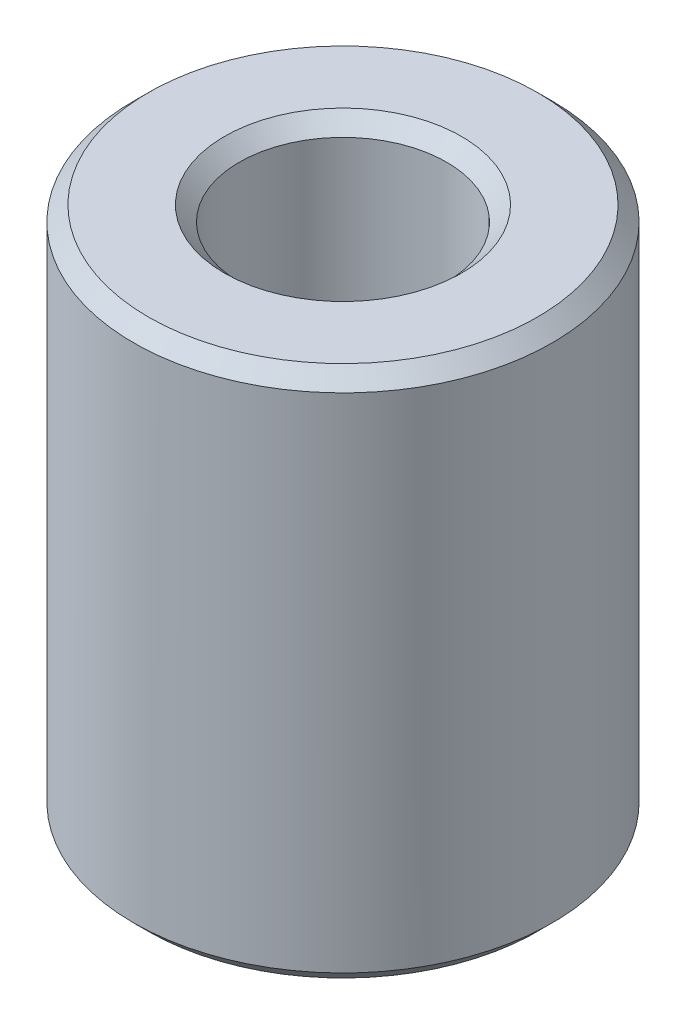
ISO-10303-21;
HEADER;
FILE_DESCRIPTION(('STEP AP214'),'2;1');
FILE_NAME('part.step','',(''),(''),'','','');
FILE_SCHEMA(('AUTOMOTIVE_DESIGN { 1 0 10303 214 1 1 1 1 }'));
ENDSEC;
DATA;
#1=APPLICATION_CONTEXT('core data for automotive mechanical design processes');
#2=APPLICATION_PROTOCOL_DEFINITION('international standard','automotive_design',2000,#1);
#3=PRODUCT_CONTEXT('',#1,'mechanical');
#4=PRODUCT('Part','Part','',(#3));
#5=PRODUCT_RELATED_PRODUCT_CATEGORY('part','',(#4));
#6=PRODUCT_DEFINITION_FORMATION('','',#4);
#7=PRODUCT_DEFINITION_CONTEXT('part definition',#1,'design');
#8=PRODUCT_DEFINITION('design','',#6,#7);
#9=PRODUCT_DEFINITION_SHAPE('','',#8);
#10=(LENGTH_UNIT() NAMED_UNIT(*) SI_UNIT(.MILLI.,.METRE.));
#11=(NAMED_UNIT(*) PLANE_ANGLE_UNIT() SI_UNIT($,.RADIAN.));
#12=(NAMED_UNIT(*) SI_UNIT($,.STERADIAN.) SOLID_ANGLE_UNIT());
#13=UNCERTAINTY_MEASURE_WITH_UNIT(LENGTH_MEASURE(1.E-05),#10,'distance_accuracy_value','');
#14=(GEOMETRIC_REPRESENTATION_CONTEXT(3) GLOBAL_UNCERTAINTY_ASSIGNED_CONTEXT((#13)) GLOBAL_UNIT_ASSIGNED_CONTEXT((#10,
#11,#12)) REPRESENTATION_CONTEXT('',''));
#15=CARTESIAN_POINT('',(0.,0.,0.));
#16=DIRECTION('',(0.,0.,1.));
#17=DIRECTION('',(1.,0.,0.));
#18=AXIS2_PLACEMENT_3D('',#15,#16,#17);
#19=CARTESIAN_POINT('',(0.,19.0598782989503,0.));
#20=DIRECTION('',(0.,-1.,0.));
#21=DIRECTION('',(0.,0.,-1.));
#22=AXIS2_PLACEMENT_3D('',#19,#20,#21);
#23=CYLINDRICAL_SURFACE('',#22,7.5);
#24=CARTESIAN_POINT('',(0.,0.532516830495152,0.));
#25=DIRECTION('',(0.,1.,0.));
#26=DIRECTION('',(0.,0.,1.));
#27=AXIS2_PLACEMENT_3D('',#24,#25,#26);
#28=CIRCLE('',#27,7.5);
#29=CARTESIAN_POINT('',(0.,0.532516830495152,7.5));
#30=VERTEX_POINT('',#29);
#31=EDGE_CURVE('E10',#30,#30,#28,.T.);
#32=ORIENTED_EDGE('',*,*,#31,.T.);
#33=EDGE_LOOP('',(#32));
#34=FACE_BOUND('',#33,.T.);
#35=CARTESIAN_POINT('',(0.,18.5273614684551,0.));
#36=DIRECTION('',(0.,1.,0.));
#37=DIRECTION('',(0.,0.,1.));
#38=AXIS2_PLACEMENT_3D('',#35,#36,#37);
#39=CIRCLE('',#38,7.5);
#40=CARTESIAN_POINT('',(0.,18.5273614684551,-7.5));
#41=VERTEX_POINT('',#40);
#42=EDGE_CURVE('E50',#41,#41,#39,.F.);
#43=ORIENTED_EDGE('',*,*,#42,.T.);
#44=EDGE_LOOP('',(#43));
#45=FACE_BOUND('',#44,.T.);
#46=ADVANCED_FACE('F39',(#34,#45),#23,.T.);
#47=CARTESIAN_POINT('',(0.,19.0598782989503,0.));
#48=DIRECTION('',(0.,1.,0.));
#49=DIRECTION('',(0.,0.,1.));
#50=AXIS2_PLACEMENT_3D('',#47,#48,#49);
#51=PLANE('',#50);
#52=CARTESIAN_POINT('',(0.,19.0598782989503,0.));
#53=DIRECTION('',(0.,1.,0.));
#54=DIRECTION('',(0.,0.,1.));
#55=AXIS2_PLACEMENT_3D('',#52,#53,#54);
#56=CIRCLE('',#55,4.24500124139866);
#57=CARTESIAN_POINT('',(0.,19.0598782989503,4.24500124139866));
#58=VERTEX_POINT('',#57);
#59=EDGE_CURVE('E58',#58,#58,#56,.F.);
#60=ORIENTED_EDGE('',*,*,#59,.T.);
#61=EDGE_LOOP('',(#60));
#62=FACE_BOUND('',#61,.T.);
#63=CARTESIAN_POINT('',(0.,19.0598782989503,0.));
#64=DIRECTION('',(0.,1.,0.));
#65=DIRECTION('',(0.,0.,1.));
#66=AXIS2_PLACEMENT_3D('',#63,#64,#65);
#67=CIRCLE('',#66,6.96748316950484);
#68=CARTESIAN_POINT('',(0.,19.0598782989503,-6.96748316950485));
#69=VERTEX_POINT('',#68);
#70=EDGE_CURVE('E61',#69,#69,#67,.T.);
#71=ORIENTED_EDGE('',*,*,#70,.T.);
#72=EDGE_LOOP('',(#71));
#73=FACE_BOUND('',#72,.T.);
#74=ADVANCED_FACE('F88',(#62,#73),#51,.T.);
#75=CARTESIAN_POINT('',(0.,0.,0.));
#76=DIRECTION('',(0.,1.,0.));
#77=DIRECTION('',(0.,0.,1.));
#78=AXIS2_PLACEMENT_3D('',#75,#76,#77);
#79=PLANE('',#78);
#80=CARTESIAN_POINT('',(0.,0.,0.));
#81=DIRECTION('',(0.,1.,0.));
#82=DIRECTION('',(0.,0.,1.));
#83=AXIS2_PLACEMENT_3D('',#80,#81,#82);
#84=CIRCLE('',#83,4.24500124139865);
#85=CARTESIAN_POINT('',(0.,0.,4.24500124139865));
#86=VERTEX_POINT('',#85);
#87=EDGE_CURVE('E51',#86,#86,#84,.T.);
#88=ORIENTED_EDGE('',*,*,#87,.T.);
#89=EDGE_LOOP('',(#88));
#90=FACE_BOUND('',#89,.T.);
#91=CARTESIAN_POINT('',(0.,0.,0.));
#92=DIRECTION('',(0.,1.,0.));
#93=DIRECTION('',(0.,0.,1.));
#94=AXIS2_PLACEMENT_3D('',#91,#92,#93);
#95=CIRCLE('',#94,6.96748316950484);
#96=CARTESIAN_POINT('',(0.,0.,6.96748316950484));
#97=VERTEX_POINT('',#96);
#98=EDGE_CURVE('E54',#97,#97,#95,.F.);
#99=ORIENTED_EDGE('',*,*,#98,.T.);
#100=EDGE_LOOP('',(#99));
#101=FACE_BOUND('',#100,.T.);
#102=ADVANCED_FACE('F83',(#90,#101),#79,.F.);
#103=CARTESIAN_POINT('',(0.,19.0598782989503,0.));
#104=DIRECTION('',(0.,-1.,0.));
#105=DIRECTION('',(0.,0.,-1.));
#106=AXIS2_PLACEMENT_3D('',#103,#104,#105);
#107=CYLINDRICAL_SURFACE('',#106,3.7124844109035);
#108=CARTESIAN_POINT('',(0.,18.5273614684551,0.));
#109=DIRECTION('',(0.,1.,0.));
#110=DIRECTION('',(0.,0.,1.));
#111=AXIS2_PLACEMENT_3D('',#108,#109,#110);
#112=CIRCLE('',#111,3.7124844109035);
#113=CARTESIAN_POINT('',(0.,18.5273614684551,3.7124844109035));
#114=VERTEX_POINT('',#113);
#115=EDGE_CURVE('E67',#114,#114,#112,.T.);
#116=ORIENTED_EDGE('',*,*,#115,.T.);
#117=EDGE_LOOP('',(#116));
#118=FACE_BOUND('',#117,.T.);
#119=CARTESIAN_POINT('',(0.,0.532516830495156,0.));
#120=DIRECTION('',(0.,1.,0.));
#121=DIRECTION('',(0.,0.,1.));
#122=AXIS2_PLACEMENT_3D('',#119,#120,#121);
#123=CIRCLE('',#122,3.7124844109035);
#124=CARTESIAN_POINT('',(0.,0.532516830495156,3.7124844109035));
#125=VERTEX_POINT('',#124);
#126=EDGE_CURVE('E69',#125,#125,#123,.F.);
#127=ORIENTED_EDGE('',*,*,#126,.T.);
#128=EDGE_LOOP('',(#127));
#129=FACE_BOUND('',#128,.T.);
#130=ADVANCED_FACE('F71',(#118,#129),#107,.F.);
#131=CARTESIAN_POINT('',(0.,18.5273614684551,0.));
#132=DIRECTION('',(0.,1.,0.));
#133=DIRECTION('',(0.,0.,1.));
#134=AXIS2_PLACEMENT_3D('',#131,#132,#133);
#135=CONICAL_SURFACE('',#134,3.7124844109035,0.785398163397455);
#136=ORIENTED_EDGE('',*,*,#59,.F.);
#137=EDGE_LOOP('',(#136));
#138=FACE_BOUND('',#137,.T.);
#139=ORIENTED_EDGE('',*,*,#115,.F.);
#140=EDGE_LOOP('',(#139));
#141=FACE_BOUND('',#140,.T.);
#142=ADVANCED_FACE('F77',(#138,#141),#135,.F.);
#143=CARTESIAN_POINT('',(0.,0.,0.));
#144=DIRECTION('',(0.,-1.,0.));
#145=DIRECTION('',(0.,0.,-1.));
#146=AXIS2_PLACEMENT_3D('',#143,#144,#145);
#147=CONICAL_SURFACE('',#146,4.24500124139865,0.785398163397445);
#148=ORIENTED_EDGE('',*,*,#126,.F.);
#149=EDGE_LOOP('',(#148));
#150=FACE_BOUND('',#149,.T.);
#151=ORIENTED_EDGE('',*,*,#87,.F.);
#152=EDGE_LOOP('',(#151));
#153=FACE_BOUND('',#152,.T.);
#154=ADVANCED_FACE('F73',(#150,#153),#147,.F.);
#155=CARTESIAN_POINT('',(0.,0.532516830495152,0.));
#156=DIRECTION('',(0.,1.,0.));
#157=DIRECTION('',(0.,0.,1.));
#158=AXIS2_PLACEMENT_3D('',#155,#156,#157);
#159=CONICAL_SURFACE('',#158,7.5,0.785398163397451);
#160=ORIENTED_EDGE('',*,*,#98,.F.);
#161=EDGE_LOOP('',(#160));
#162=FACE_BOUND('',#161,.T.);
#163=ORIENTED_EDGE('',*,*,#31,.F.);
#164=EDGE_LOOP('',(#163));
#165=FACE_BOUND('',#164,.T.);
#166=ADVANCED_FACE('F76',(#162,#165),#159,.T.);
#167=CARTESIAN_POINT('',(0.,19.0598782989503,0.));
#168=DIRECTION('',(0.,-1.,0.));
#169=DIRECTION('',(0.,0.,-1.));
#170=AXIS2_PLACEMENT_3D('',#167,#168,#169);
#171=CONICAL_SURFACE('',#170,6.96748316950484,0.785398163397445);
#172=CARTESIAN_POINT('',(0.,18.5273614684551,-7.5));
#173=CARTESIAN_POINT('',(0.,18.5329085187728,-7.49445294968234));
#174=CARTESIAN_POINT('',(0.,18.5384555690904,-7.48890589936468));
#175=CARTESIAN_POINT('',(0.,18.5495496697258,-7.47781179872937));
#176=CARTESIAN_POINT('',(0.,18.5550967200434,-7.47226474841171));
#177=CARTESIAN_POINT('',(0.,18.5661908206787,-7.4611706477764));
#178=CARTESIAN_POINT('',(0.,18.5717378709964,-7.45562359745874));
#179=CARTESIAN_POINT('',(0.,18.5828319716317,-7.44452949682342));
#180=CARTESIAN_POINT('',(0.,18.5883790219494,-7.43898244650577));
#181=CARTESIAN_POINT('',(0.,18.5994731225847,-7.42788834587045));
#182=CARTESIAN_POINT('',(0.,18.6050201729023,-7.42234129555279));
#183=CARTESIAN_POINT('',(0.,18.6161142735377,-7.41124719491748));
#184=CARTESIAN_POINT('',(0.,18.6216613238553,-7.40570014459982));
#185=CARTESIAN_POINT('',(0.,18.6327554244906,-7.3946060439645));
#186=CARTESIAN_POINT('',(0.,18.6383024748083,-7.38905899364684));
#187=CARTESIAN_POINT('',(0.,18.6493965754436,-7.37796489301153));
#188=CARTESIAN_POINT('',(0.,18.6549436257613,-7.37241784269387));
#189=CARTESIAN_POINT('',(0.,18.6660377263966,-7.36132374205855));
#190=CARTESIAN_POINT('',(0.,18.6715847767142,-7.3557766917409));
#191=CARTESIAN_POINT('',(0.,18.6826788773495,-7.34468259110558));
#192=CARTESIAN_POINT('',(0.,18.6882259276672,-7.33913554078792));
#193=CARTESIAN_POINT('',(0.,18.6993200283025,-7.32804144015261));
#194=CARTESIAN_POINT('',(0.,18.7048670786202,-7.32249438983495));
#195=CARTESIAN_POINT('',(0.,18.7159611792555,-7.31140028919963));
#196=CARTESIAN_POINT('',(0.,18.7215082295732,-7.30585323888198));
#197=CARTESIAN_POINT('',(0.,18.7326023302085,-7.29475913824666));
#198=CARTESIAN_POINT('',(0.,18.7381493805261,-7.289212087929));
#199=CARTESIAN_POINT('',(0.,18.7492434811614,-7.27811798729369));
#200=CARTESIAN_POINT('',(0.,18.7547905314791,-7.27257093697603));
#201=CARTESIAN_POINT('',(0.,18.7658846321144,-7.26147683634071));
#202=CARTESIAN_POINT('',(0.,18.7714316824321,-7.25592978602306));
#203=CARTESIAN_POINT('',(0.,18.7825257830674,-7.24483568538774));
#204=CARTESIAN_POINT('',(0.,18.788072833385,-7.23928863507008));
#205=CARTESIAN_POINT('',(0.,18.7991669340204,-7.22819453443477));
#206=CARTESIAN_POINT('',(0.,18.804713984338,-7.22264748411711));
#207=CARTESIAN_POINT('',(0.,18.8158080849733,-7.21155338348179));
#208=CARTESIAN_POINT('',(0.,18.821355135291,-7.20600633316413));
#209=CARTESIAN_POINT('',(0.,18.8324492359263,-7.19491223252882));
#210=CARTESIAN_POINT('',(0.,18.837996286244,-7.18936518221116));
#211=CARTESIAN_POINT('',(0.,18.8490903868793,-7.17827108157585));
#212=CARTESIAN_POINT('',(0.,18.8546374371969,-7.17272403125819));
#213=CARTESIAN_POINT('',(0.,18.8657315378323,-7.16162993062287));
#214=CARTESIAN_POINT('',(0.,18.8712785881499,-7.15608288030521));
#215=CARTESIAN_POINT('',(0.,18.8823726887852,-7.1449887796699));
#216=CARTESIAN_POINT('',(0.,18.8879197391029,-7.13944172935224));
#217=CARTESIAN_POINT('',(0.,18.8990138397382,-7.12834762871692));
#218=CARTESIAN_POINT('',(0.,18.9045608900559,-7.12280057839927));
#219=CARTESIAN_POINT('',(0.,18.9156549906912,-7.11170647776395));
#220=CARTESIAN_POINT('',(0.,18.9212020410088,-7.10615942744629));
#221=CARTESIAN_POINT('',(0.,18.9322961416442,-7.09506532681098));
#222=CARTESIAN_POINT('',(0.,18.9378431919618,-7.08951827649332));
#223=CARTESIAN_POINT('',(0.,18.9489372925971,-7.078424175858));
#224=CARTESIAN_POINT('',(0.,18.9544843429148,-7.07287712554035));
#225=CARTESIAN_POINT('',(0.,18.9655784435501,-7.06178302490503));
#226=CARTESIAN_POINT('',(0.,18.9711254938678,-7.05623597458737));
#227=CARTESIAN_POINT('',(0.,18.9822195945031,-7.04514187395206));
#228=CARTESIAN_POINT('',(0.,18.9877666448207,-7.0395948236344));
#229=CARTESIAN_POINT('',(0.,18.998860745456,-7.02850072299908));
#230=CARTESIAN_POINT('',(0.,19.0044077957737,-7.02295367268142));
#231=CARTESIAN_POINT('',(0.,19.015501896409,-7.01185957204611));
#232=CARTESIAN_POINT('',(0.,19.0210489467267,-7.00631252172845));
#233=CARTESIAN_POINT('',(0.,19.032143047362,-6.99521842109313));
#234=CARTESIAN_POINT('',(0.,19.0376900976797,-6.98967137077548));
#235=CARTESIAN_POINT('',(0.,19.048784198315,-6.97857727014016));
#236=CARTESIAN_POINT('',(0.,19.0543312486326,-6.9730302198225));
#237=CARTESIAN_POINT('',(0.,19.0598782989503,-6.96748316950485));
#238=B_SPLINE_CURVE_WITH_KNOTS('',3,(#172,#173,#174,#175,#176,#177,#178,#179,#180,#181,#182,
#183,#184,#185,#186,#187,#188,#189,#190,#191,#192,#193,#194,#195,#196,#197,#198,#199,#200,#201,
#202,#203,#204,#205,#206,#207,#208,#209,#210,#211,#212,#213,#214,#215,#216,#217,#218,#219,#220,
#221,#222,#223,#224,#225,#226,#227,#228,#229,#230,#231,#232,#233,#234,#235,#236,#237),
.UNSPECIFIED.,.F.,.F.,(4,2,2,2,2,2,2,2,2,2,2,2,2,2,2,2,2,2,2,2,2,2,2,2,2,2,2,2,2,2,2,2,4),(0.,
0.0235341413711932,0.0470682827423889,0.0706024241135822,0.0941365654847754,0.117670706855969,
0.141204848227162,0.164738989598355,0.188273130969548,0.211807272340742,0.235341413711935,
0.258875555083128,0.282409696454321,0.305943837825514,0.329477979196708,0.353012120567901,
0.376546261939094,0.400080403310288,0.423614544681481,0.447148686052674,0.470682827423867,
0.494216968795061,0.517751110166254,0.541285251537447,0.56481939290864,0.588353534279834,
0.611887675651027,0.63542181702222,0.658955958393413,0.682490099764607,0.7060242411358,
0.729558382506993,0.753092523878189),.UNSPECIFIED.);
#239=EDGE_CURVE('BSEAM45',#41,#69,#238,.T.);
#240=ORIENTED_EDGE('',*,*,#42,.F.);
#241=ORIENTED_EDGE('',*,*,#70,.F.);
#242=ORIENTED_EDGE('',*,*,#239,.T.);
#243=ORIENTED_EDGE('',*,*,#239,.F.);
#244=EDGE_LOOP('',(#240,#242,#241,#243));
#245=FACE_BOUND('',#244,.T.);
#246=ADVANCED_FACE('F45',(#245),#171,.T.);
#247=CLOSED_SHELL('',(#46,#74,#102,#130,#142,#154,#166,#246));
#248=MANIFOLD_SOLID_BREP('B2',#247);
#249=ADVANCED_BREP_SHAPE_REPRESENTATION('',(#18,#248),#14);
#250=SHAPE_DEFINITION_REPRESENTATION(#9,#249);
ENDSEC;
END-ISO-10303-21;
